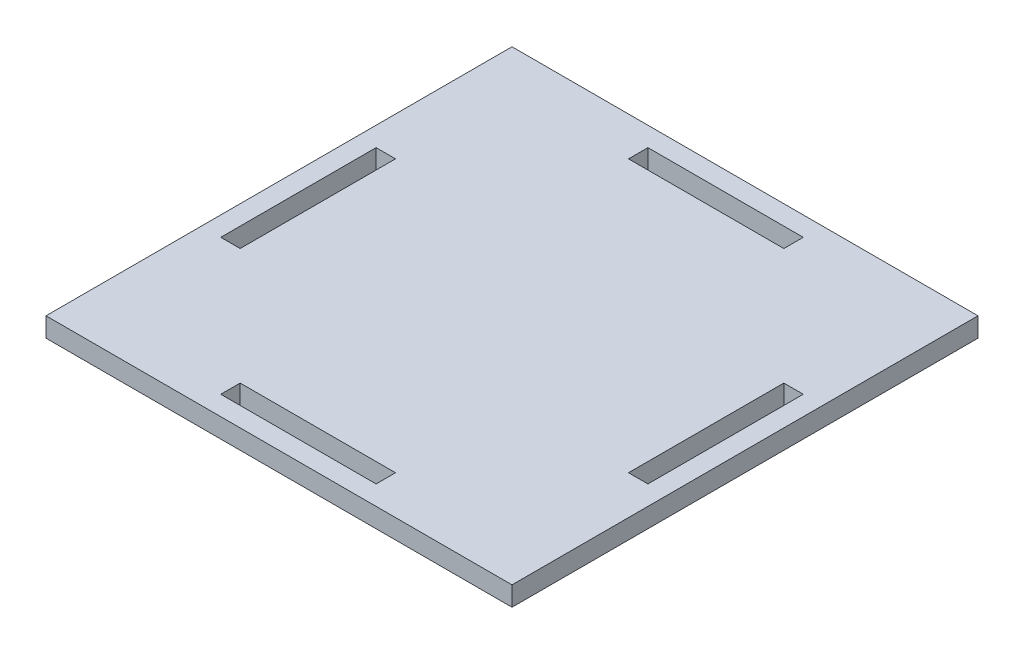
ISO-10303-21;
HEADER;
FILE_DESCRIPTION(('STEP AP214'),'2;1');
FILE_NAME('part.step','',(''),(''),'','','');
FILE_SCHEMA(('AUTOMOTIVE_DESIGN { 1 0 10303 214 1 1 1 1 }'));
ENDSEC;
DATA;
#1=APPLICATION_CONTEXT('core data for automotive mechanical design processes');
#2=APPLICATION_PROTOCOL_DEFINITION('international standard','automotive_design',2000,#1);
#3=PRODUCT_CONTEXT('',#1,'mechanical');
#4=PRODUCT('Part','Part','',(#3));
#5=PRODUCT_RELATED_PRODUCT_CATEGORY('part','',(#4));
#6=PRODUCT_DEFINITION_FORMATION('','',#4);
#7=PRODUCT_DEFINITION_CONTEXT('part definition',#1,'design');
#8=PRODUCT_DEFINITION('design','',#6,#7);
#9=PRODUCT_DEFINITION_SHAPE('','',#8);
#10=(LENGTH_UNIT() NAMED_UNIT(*) SI_UNIT(.MILLI.,.METRE.));
#11=(NAMED_UNIT(*) PLANE_ANGLE_UNIT() SI_UNIT($,.RADIAN.));
#12=(NAMED_UNIT(*) SI_UNIT($,.STERADIAN.) SOLID_ANGLE_UNIT());
#13=UNCERTAINTY_MEASURE_WITH_UNIT(LENGTH_MEASURE(1.E-05),#10,'distance_accuracy_value','');
#14=(GEOMETRIC_REPRESENTATION_CONTEXT(3) GLOBAL_UNCERTAINTY_ASSIGNED_CONTEXT((#13)) GLOBAL_UNIT_ASSIGNED_CONTEXT((#10,
#11,#12)) REPRESENTATION_CONTEXT('',''));
#15=CARTESIAN_POINT('',(0.,0.,0.));
#16=DIRECTION('',(0.,0.,1.));
#17=DIRECTION('',(1.,0.,0.));
#18=AXIS2_PLACEMENT_3D('',#15,#16,#17);
#19=CARTESIAN_POINT('',(0.,6.35,0.));
#20=DIRECTION('',(0.,1.,0.));
#21=DIRECTION('',(0.,0.,1.));
#22=AXIS2_PLACEMENT_3D('',#19,#20,#21);
#23=PLANE('',#22);
#24=DIRECTION('',(1.,0.,0.));
#25=VECTOR('',#24,1.);
#26=CARTESIAN_POINT('',(0.,6.35,0.));
#27=LINE('',#26,#25);
#28=CARTESIAN_POINT('',(0.,6.35,0.));
#29=VERTEX_POINT('',#28);
#30=CARTESIAN_POINT('',(152.4,6.35,0.));
#31=VERTEX_POINT('',#30);
#32=EDGE_CURVE('E322',#29,#31,#27,.T.);
#33=ORIENTED_EDGE('',*,*,#32,.T.);
#34=DIRECTION('',(0.,0.,-1.));
#35=VECTOR('',#34,1.);
#36=CARTESIAN_POINT('',(152.4,6.35,0.));
#37=LINE('',#36,#35);
#38=CARTESIAN_POINT('',(152.4,6.35,-152.4));
#39=VERTEX_POINT('',#38);
#40=EDGE_CURVE('E325',#31,#39,#37,.T.);
#41=ORIENTED_EDGE('',*,*,#40,.T.);
#42=DIRECTION('',(-1.,0.,0.));
#43=VECTOR('',#42,1.);
#44=CARTESIAN_POINT('',(0.,6.35,-152.4));
#45=LINE('',#44,#43);
#46=CARTESIAN_POINT('',(0.,6.35,-152.4));
#47=VERTEX_POINT('',#46);
#48=EDGE_CURVE('E328',#39,#47,#45,.T.);
#49=ORIENTED_EDGE('',*,*,#48,.T.);
#50=DIRECTION('',(0.,0.,1.));
#51=VECTOR('',#50,1.);
#52=CARTESIAN_POINT('',(0.,6.35,0.));
#53=LINE('',#52,#51);
#54=EDGE_CURVE('E330',#47,#29,#53,.T.);
#55=ORIENTED_EDGE('',*,*,#54,.T.);
#56=EDGE_LOOP('',(#33,#41,#49,#55));
#57=FACE_BOUND('',#56,.T.);
#58=DIRECTION('',(0.,0.,-1.));
#59=VECTOR('',#58,1.);
#60=CARTESIAN_POINT('',(50.7999999999997,6.35,1.11022302462515E-13));
#61=LINE('',#60,#59);
#62=CARTESIAN_POINT('',(50.8,6.35,-139.7));
#63=VERTEX_POINT('',#62);
#64=CARTESIAN_POINT('',(50.8000000000001,6.35,-146.05));
#65=VERTEX_POINT('',#64);
#66=EDGE_CURVE('E285',#63,#65,#61,.T.);
#67=ORIENTED_EDGE('',*,*,#66,.T.);
#68=DIRECTION('',(1.,0.,0.));
#69=VECTOR('',#68,1.);
#70=CARTESIAN_POINT('',(1.59594559789866E-13,6.35,-146.05));
#71=LINE('',#70,#69);
#72=CARTESIAN_POINT('',(101.6,6.35,-146.05));
#73=VERTEX_POINT('',#72);
#74=EDGE_CURVE('E288',#65,#73,#71,.T.);
#75=ORIENTED_EDGE('',*,*,#74,.T.);
#76=DIRECTION('',(0.,0.,1.));
#77=VECTOR('',#76,1.);
#78=CARTESIAN_POINT('',(101.6,6.35,0.));
#79=LINE('',#78,#77);
#80=CARTESIAN_POINT('',(101.6,6.35,-139.7));
#81=VERTEX_POINT('',#80);
#82=EDGE_CURVE('E245',#73,#81,#79,.T.);
#83=ORIENTED_EDGE('',*,*,#82,.T.);
#84=DIRECTION('',(-1.,0.,0.));
#85=VECTOR('',#84,1.);
#86=CARTESIAN_POINT('',(1.52655665885959E-13,6.35,-139.7));
#87=LINE('',#86,#85);
#88=EDGE_CURVE('E191',#81,#63,#87,.T.);
#89=ORIENTED_EDGE('',*,*,#88,.T.);
#90=EDGE_LOOP('',(#67,#75,#83,#89));
#91=FACE_BOUND('',#90,.T.);
#92=DIRECTION('',(-1.,0.,0.));
#93=VECTOR('',#92,1.);
#94=CARTESIAN_POINT('',(0.,6.35,-6.35));
#95=LINE('',#94,#93);
#96=CARTESIAN_POINT('',(101.6,6.35,-6.35));
#97=VERTEX_POINT('',#96);
#98=CARTESIAN_POINT('',(50.8,6.35,-6.35));
#99=VERTEX_POINT('',#98);
#100=EDGE_CURVE('E297',#97,#99,#95,.T.);
#101=ORIENTED_EDGE('',*,*,#100,.T.);
#102=DIRECTION('',(0.,0.,-1.));
#103=VECTOR('',#102,1.);
#104=CARTESIAN_POINT('',(50.8,6.35,0.));
#105=LINE('',#104,#103);
#106=CARTESIAN_POINT('',(50.8,6.35,-12.7));
#107=VERTEX_POINT('',#106);
#108=EDGE_CURVE('E300',#99,#107,#105,.T.);
#109=ORIENTED_EDGE('',*,*,#108,.T.);
#110=DIRECTION('',(1.,0.,0.));
#111=VECTOR('',#110,1.);
#112=CARTESIAN_POINT('',(0.,6.35,-12.7));
#113=LINE('',#112,#111);
#114=CARTESIAN_POINT('',(101.6,6.35,-12.7));
#115=VERTEX_POINT('',#114);
#116=EDGE_CURVE('E291',#107,#115,#113,.T.);
#117=ORIENTED_EDGE('',*,*,#116,.T.);
#118=DIRECTION('',(0.,0.,1.));
#119=VECTOR('',#118,1.);
#120=CARTESIAN_POINT('',(101.6,6.35,0.));
#121=LINE('',#120,#119);
#122=EDGE_CURVE('E294',#115,#97,#121,.T.);
#123=ORIENTED_EDGE('',*,*,#122,.T.);
#124=EDGE_LOOP('',(#101,#109,#117,#123));
#125=FACE_BOUND('',#124,.T.);
#126=DIRECTION('',(1.,0.,0.));
#127=VECTOR('',#126,1.);
#128=CARTESIAN_POINT('',(2.22044604925031E-13,6.35,-101.6));
#129=LINE('',#128,#127);
#130=CARTESIAN_POINT('',(139.7,6.35,-101.6));
#131=VERTEX_POINT('',#130);
#132=CARTESIAN_POINT('',(146.05,6.35,-101.6));
#133=VERTEX_POINT('',#132);
#134=EDGE_CURVE('E309',#131,#133,#129,.T.);
#135=ORIENTED_EDGE('',*,*,#134,.T.);
#136=DIRECTION('',(0.,0.,1.));
#137=VECTOR('',#136,1.);
#138=CARTESIAN_POINT('',(146.05,6.35,1.59594559789866E-13));
#139=LINE('',#138,#137);
#140=CARTESIAN_POINT('',(146.05,6.35,-50.8));
#141=VERTEX_POINT('',#140);
#142=EDGE_CURVE('E312',#133,#141,#139,.T.);
#143=ORIENTED_EDGE('',*,*,#142,.T.);
#144=DIRECTION('',(-1.,0.,0.));
#145=VECTOR('',#144,1.);
#146=CARTESIAN_POINT('',(0.,6.35,-50.8));
#147=LINE('',#146,#145);
#148=CARTESIAN_POINT('',(139.7,6.35,-50.8));
#149=VERTEX_POINT('',#148);
#150=EDGE_CURVE('E303',#141,#149,#147,.T.);
#151=ORIENTED_EDGE('',*,*,#150,.T.);
#152=DIRECTION('',(0.,0.,-1.));
#153=VECTOR('',#152,1.);
#154=CARTESIAN_POINT('',(139.7,6.35,0.));
#155=LINE('',#154,#153);
#156=EDGE_CURVE('E306',#149,#131,#155,.T.);
#157=ORIENTED_EDGE('',*,*,#156,.T.);
#158=EDGE_LOOP('',(#135,#143,#151,#157));
#159=FACE_BOUND('',#158,.T.);
#160=DIRECTION('',(-1.,0.,0.));
#161=VECTOR('',#160,1.);
#162=CARTESIAN_POINT('',(0.,6.35,-50.8));
#163=LINE('',#162,#161);
#164=CARTESIAN_POINT('',(12.7,6.35,-50.8));
#165=VERTEX_POINT('',#164);
#166=CARTESIAN_POINT('',(6.35000000000001,6.35,-50.8));
#167=VERTEX_POINT('',#166);
#168=EDGE_CURVE('E318',#165,#167,#163,.T.);
#169=ORIENTED_EDGE('',*,*,#168,.T.);
#170=DIRECTION('',(0.,0.,-1.));
#171=VECTOR('',#170,1.);
#172=CARTESIAN_POINT('',(6.35000000000001,6.35,0.));
#173=LINE('',#172,#171);
#174=CARTESIAN_POINT('',(6.35000000000001,6.35,-101.6));
#175=VERTEX_POINT('',#174);
#176=EDGE_CURVE('E244',#167,#175,#173,.T.);
#177=ORIENTED_EDGE('',*,*,#176,.T.);
#178=DIRECTION('',(1.,0.,0.));
#179=VECTOR('',#178,1.);
#180=CARTESIAN_POINT('',(0.,6.35,-101.6));
#181=LINE('',#180,#179);
#182=CARTESIAN_POINT('',(12.7,6.35,-101.6));
#183=VERTEX_POINT('',#182);
#184=EDGE_CURVE('E315',#175,#183,#181,.T.);
#185=ORIENTED_EDGE('',*,*,#184,.T.);
#186=DIRECTION('',(0.,0.,1.));
#187=VECTOR('',#186,1.);
#188=CARTESIAN_POINT('',(12.7,6.35,0.));
#189=LINE('',#188,#187);
#190=EDGE_CURVE('E252',#183,#165,#189,.T.);
#191=ORIENTED_EDGE('',*,*,#190,.T.);
#192=EDGE_LOOP('',(#169,#177,#185,#191));
#193=FACE_BOUND('',#192,.T.);
#194=ADVANCED_FACE('F36',(#57,#91,#125,#159,#193),#23,.T.);
#195=CARTESIAN_POINT('',(0.,0.,0.));
#196=DIRECTION('',(0.,1.,0.));
#197=DIRECTION('',(0.,0.,1.));
#198=AXIS2_PLACEMENT_3D('',#195,#196,#197);
#199=PLANE('',#198);
#200=DIRECTION('',(0.,0.,1.));
#201=VECTOR('',#200,1.);
#202=CARTESIAN_POINT('',(146.05,0.,1.59594559789866E-13));
#203=LINE('',#202,#201);
#204=CARTESIAN_POINT('',(146.05,0.,-101.6));
#205=VERTEX_POINT('',#204);
#206=CARTESIAN_POINT('',(146.05,0.,-50.8));
#207=VERTEX_POINT('',#206);
#208=EDGE_CURVE('E220',#205,#207,#203,.T.);
#209=ORIENTED_EDGE('',*,*,#208,.F.);
#210=DIRECTION('',(1.,0.,0.));
#211=VECTOR('',#210,1.);
#212=CARTESIAN_POINT('',(2.22044604925031E-13,0.,-101.6));
#213=LINE('',#212,#211);
#214=CARTESIAN_POINT('',(139.7,0.,-101.6));
#215=VERTEX_POINT('',#214);
#216=EDGE_CURVE('E218',#215,#205,#213,.T.);
#217=ORIENTED_EDGE('',*,*,#216,.F.);
#218=DIRECTION('',(0.,0.,-1.));
#219=VECTOR('',#218,1.);
#220=CARTESIAN_POINT('',(139.7,0.,0.));
#221=LINE('',#220,#219);
#222=CARTESIAN_POINT('',(139.7,0.,-50.8));
#223=VERTEX_POINT('',#222);
#224=EDGE_CURVE('E216',#223,#215,#221,.T.);
#225=ORIENTED_EDGE('',*,*,#224,.F.);
#226=DIRECTION('',(-1.,0.,0.));
#227=VECTOR('',#226,1.);
#228=CARTESIAN_POINT('',(0.,0.,-50.8));
#229=LINE('',#228,#227);
#230=EDGE_CURVE('E214',#207,#223,#229,.T.);
#231=ORIENTED_EDGE('',*,*,#230,.F.);
#232=EDGE_LOOP('',(#209,#217,#225,#231));
#233=FACE_BOUND('',#232,.T.);
#234=DIRECTION('',(1.,0.,0.));
#235=VECTOR('',#234,1.);
#236=CARTESIAN_POINT('',(1.59594559789866E-13,0.,-146.05));
#237=LINE('',#236,#235);
#238=CARTESIAN_POINT('',(50.8000000000001,0.,-146.05));
#239=VERTEX_POINT('',#238);
#240=CARTESIAN_POINT('',(101.6,0.,-146.05));
#241=VERTEX_POINT('',#240);
#242=EDGE_CURVE('E200',#239,#241,#237,.T.);
#243=ORIENTED_EDGE('',*,*,#242,.F.);
#244=DIRECTION('',(0.,0.,-1.));
#245=VECTOR('',#244,1.);
#246=CARTESIAN_POINT('',(50.7999999999997,0.,1.11022302462515E-13));
#247=LINE('',#246,#245);
#248=CARTESIAN_POINT('',(50.8,0.,-139.7));
#249=VERTEX_POINT('',#248);
#250=EDGE_CURVE('E198',#249,#239,#247,.T.);
#251=ORIENTED_EDGE('',*,*,#250,.F.);
#252=DIRECTION('',(-1.,0.,0.));
#253=VECTOR('',#252,1.);
#254=CARTESIAN_POINT('',(1.52655665885959E-13,0.,-139.7));
#255=LINE('',#254,#253);
#256=CARTESIAN_POINT('',(101.6,0.,-139.7));
#257=VERTEX_POINT('',#256);
#258=EDGE_CURVE('E183',#257,#249,#255,.T.);
#259=ORIENTED_EDGE('',*,*,#258,.F.);
#260=DIRECTION('',(0.,0.,1.));
#261=VECTOR('',#260,1.);
#262=CARTESIAN_POINT('',(101.6,0.,0.));
#263=LINE('',#262,#261);
#264=EDGE_CURVE('E172',#241,#257,#263,.T.);
#265=ORIENTED_EDGE('',*,*,#264,.F.);
#266=EDGE_LOOP('',(#243,#251,#259,#265));
#267=FACE_BOUND('',#266,.T.);
#268=DIRECTION('',(1.,0.,0.));
#269=VECTOR('',#268,1.);
#270=CARTESIAN_POINT('',(0.,0.,0.));
#271=LINE('',#270,#269);
#272=CARTESIAN_POINT('',(0.,0.,0.));
#273=VERTEX_POINT('',#272);
#274=CARTESIAN_POINT('',(152.4,0.,0.));
#275=VERTEX_POINT('',#274);
#276=EDGE_CURVE('E321',#273,#275,#271,.T.);
#277=ORIENTED_EDGE('',*,*,#276,.F.);
#278=DIRECTION('',(0.,0.,1.));
#279=VECTOR('',#278,1.);
#280=CARTESIAN_POINT('',(0.,0.,0.));
#281=LINE('',#280,#279);
#282=CARTESIAN_POINT('',(0.,0.,-152.4));
#283=VERTEX_POINT('',#282);
#284=EDGE_CURVE('E326',#283,#273,#281,.T.);
#285=ORIENTED_EDGE('',*,*,#284,.F.);
#286=DIRECTION('',(-1.,0.,0.));
#287=VECTOR('',#286,1.);
#288=CARTESIAN_POINT('',(0.,0.,-152.4));
#289=LINE('',#288,#287);
#290=CARTESIAN_POINT('',(152.4,0.,-152.4));
#291=VERTEX_POINT('',#290);
#292=EDGE_CURVE('E337',#291,#283,#289,.T.);
#293=ORIENTED_EDGE('',*,*,#292,.F.);
#294=DIRECTION('',(0.,0.,-1.));
#295=VECTOR('',#294,1.);
#296=CARTESIAN_POINT('',(152.4,0.,0.));
#297=LINE('',#296,#295);
#298=EDGE_CURVE('E335',#275,#291,#297,.T.);
#299=ORIENTED_EDGE('',*,*,#298,.F.);
#300=EDGE_LOOP('',(#277,#285,#293,#299));
#301=FACE_BOUND('',#300,.T.);
#302=DIRECTION('',(0.,0.,-1.));
#303=VECTOR('',#302,1.);
#304=CARTESIAN_POINT('',(50.8,0.,0.));
#305=LINE('',#304,#303);
#306=CARTESIAN_POINT('',(50.8,0.,-6.35));
#307=VERTEX_POINT('',#306);
#308=CARTESIAN_POINT('',(50.8,0.,-12.7));
#309=VERTEX_POINT('',#308);
#310=EDGE_CURVE('E211',#307,#309,#305,.T.);
#311=ORIENTED_EDGE('',*,*,#310,.F.);
#312=DIRECTION('',(-1.,0.,0.));
#313=VECTOR('',#312,1.);
#314=CARTESIAN_POINT('',(0.,0.,-6.35));
#315=LINE('',#314,#313);
#316=CARTESIAN_POINT('',(101.6,0.,-6.35));
#317=VERTEX_POINT('',#316);
#318=EDGE_CURVE('E209',#317,#307,#315,.T.);
#319=ORIENTED_EDGE('',*,*,#318,.F.);
#320=DIRECTION('',(0.,0.,1.));
#321=VECTOR('',#320,1.);
#322=CARTESIAN_POINT('',(101.6,0.,0.));
#323=LINE('',#322,#321);
#324=CARTESIAN_POINT('',(101.6,0.,-12.7));
#325=VERTEX_POINT('',#324);
#326=EDGE_CURVE('E207',#325,#317,#323,.T.);
#327=ORIENTED_EDGE('',*,*,#326,.F.);
#328=DIRECTION('',(1.,0.,0.));
#329=VECTOR('',#328,1.);
#330=CARTESIAN_POINT('',(0.,0.,-12.7));
#331=LINE('',#330,#329);
#332=EDGE_CURVE('E205',#309,#325,#331,.T.);
#333=ORIENTED_EDGE('',*,*,#332,.F.);
#334=EDGE_LOOP('',(#311,#319,#327,#333));
#335=FACE_BOUND('',#334,.T.);
#336=DIRECTION('',(0.,0.,-1.));
#337=VECTOR('',#336,1.);
#338=CARTESIAN_POINT('',(6.35000000000001,0.,0.));
#339=LINE('',#338,#337);
#340=CARTESIAN_POINT('',(6.35000000000001,0.,-50.8));
#341=VERTEX_POINT('',#340);
#342=CARTESIAN_POINT('',(6.35000000000001,0.,-101.6));
#343=VERTEX_POINT('',#342);
#344=EDGE_CURVE('E11',#341,#343,#339,.T.);
#345=ORIENTED_EDGE('',*,*,#344,.F.);
#346=DIRECTION('',(-1.,0.,0.));
#347=VECTOR('',#346,1.);
#348=CARTESIAN_POINT('',(0.,0.,-50.8));
#349=LINE('',#348,#347);
#350=CARTESIAN_POINT('',(12.7,0.,-50.8));
#351=VERTEX_POINT('',#350);
#352=EDGE_CURVE('E44',#351,#341,#349,.T.);
#353=ORIENTED_EDGE('',*,*,#352,.F.);
#354=DIRECTION('',(0.,0.,1.));
#355=VECTOR('',#354,1.);
#356=CARTESIAN_POINT('',(12.7,0.,0.));
#357=LINE('',#356,#355);
#358=CARTESIAN_POINT('',(12.7,0.,-101.6));
#359=VERTEX_POINT('',#358);
#360=EDGE_CURVE('E225',#359,#351,#357,.T.);
#361=ORIENTED_EDGE('',*,*,#360,.F.);
#362=DIRECTION('',(1.,0.,0.));
#363=VECTOR('',#362,1.);
#364=CARTESIAN_POINT('',(0.,0.,-101.6));
#365=LINE('',#364,#363);
#366=EDGE_CURVE('E223',#343,#359,#365,.T.);
#367=ORIENTED_EDGE('',*,*,#366,.F.);
#368=EDGE_LOOP('',(#345,#353,#361,#367));
#369=FACE_BOUND('',#368,.T.);
#370=ADVANCED_FACE('F196',(#233,#267,#301,#335,#369),#199,.F.);
#371=CARTESIAN_POINT('',(0.,6.35,0.));
#372=DIRECTION('',(0.,0.,-1.));
#373=DIRECTION('',(-1.,0.,0.));
#374=AXIS2_PLACEMENT_3D('',#371,#372,#373);
#375=PLANE('',#374);
#376=ORIENTED_EDGE('',*,*,#276,.T.);
#377=DIRECTION('',(0.,-1.,0.));
#378=VECTOR('',#377,1.);
#379=CARTESIAN_POINT('',(152.4,6.35,0.));
#380=LINE('',#379,#378);
#381=EDGE_CURVE('E184',#31,#275,#380,.T.);
#382=ORIENTED_EDGE('',*,*,#381,.F.);
#383=ORIENTED_EDGE('',*,*,#32,.F.);
#384=DIRECTION('',(0.,-1.,0.));
#385=VECTOR('',#384,1.);
#386=CARTESIAN_POINT('',(0.,6.35,0.));
#387=LINE('',#386,#385);
#388=EDGE_CURVE('E332',#29,#273,#387,.T.);
#389=ORIENTED_EDGE('',*,*,#388,.T.);
#390=EDGE_LOOP('',(#376,#382,#383,#389));
#391=FACE_BOUND('',#390,.T.);
#392=ADVANCED_FACE('F38',(#391),#375,.F.);
#393=CARTESIAN_POINT('',(152.4,6.35,0.));
#394=DIRECTION('',(-1.,0.,0.));
#395=DIRECTION('',(0.,0.,1.));
#396=AXIS2_PLACEMENT_3D('',#393,#394,#395);
#397=PLANE('',#396);
#398=ORIENTED_EDGE('',*,*,#298,.T.);
#399=DIRECTION('',(0.,-1.,0.));
#400=VECTOR('',#399,1.);
#401=CARTESIAN_POINT('',(152.4,6.35,-152.4));
#402=LINE('',#401,#400);
#403=EDGE_CURVE('E345',#39,#291,#402,.T.);
#404=ORIENTED_EDGE('',*,*,#403,.F.);
#405=ORIENTED_EDGE('',*,*,#40,.F.);
#406=ORIENTED_EDGE('',*,*,#381,.T.);
#407=EDGE_LOOP('',(#398,#404,#405,#406));
#408=FACE_BOUND('',#407,.T.);
#409=ADVANCED_FACE('F350',(#408),#397,.F.);
#410=CARTESIAN_POINT('',(0.,6.35,-152.4));
#411=DIRECTION('',(0.,0.,1.));
#412=DIRECTION('',(1.,0.,0.));
#413=AXIS2_PLACEMENT_3D('',#410,#411,#412);
#414=PLANE('',#413);
#415=ORIENTED_EDGE('',*,*,#292,.T.);
#416=DIRECTION('',(0.,-1.,0.));
#417=VECTOR('',#416,1.);
#418=CARTESIAN_POINT('',(0.,6.35,-152.4));
#419=LINE('',#418,#417);
#420=EDGE_CURVE('E342',#47,#283,#419,.T.);
#421=ORIENTED_EDGE('',*,*,#420,.F.);
#422=ORIENTED_EDGE('',*,*,#48,.F.);
#423=ORIENTED_EDGE('',*,*,#403,.T.);
#424=EDGE_LOOP('',(#415,#421,#422,#423));
#425=FACE_BOUND('',#424,.T.);
#426=ADVANCED_FACE('F361',(#425),#414,.F.);
#427=CARTESIAN_POINT('',(0.,6.35,0.));
#428=DIRECTION('',(1.,0.,0.));
#429=DIRECTION('',(0.,0.,-1.));
#430=AXIS2_PLACEMENT_3D('',#427,#428,#429);
#431=PLANE('',#430);
#432=ORIENTED_EDGE('',*,*,#284,.T.);
#433=ORIENTED_EDGE('',*,*,#388,.F.);
#434=ORIENTED_EDGE('',*,*,#54,.F.);
#435=ORIENTED_EDGE('',*,*,#420,.T.);
#436=EDGE_LOOP('',(#432,#433,#434,#435));
#437=FACE_BOUND('',#436,.T.);
#438=ADVANCED_FACE('F365',(#437),#431,.F.);
#439=CARTESIAN_POINT('',(50.8000000000001,12.7,-146.05));
#440=DIRECTION('',(0.,0.,1.));
#441=DIRECTION('',(1.,0.,0.));
#442=AXIS2_PLACEMENT_3D('',#439,#440,#441);
#443=PLANE('',#442);
#444=DIRECTION('',(0.,-1.,0.));
#445=VECTOR('',#444,1.);
#446=CARTESIAN_POINT('',(50.8000000000001,12.7,-146.05));
#447=LINE('',#446,#445);
#448=EDGE_CURVE('E271',#65,#239,#447,.T.);
#449=ORIENTED_EDGE('',*,*,#448,.T.);
#450=ORIENTED_EDGE('',*,*,#242,.T.);
#451=DIRECTION('',(0.,-1.,0.));
#452=VECTOR('',#451,1.);
#453=CARTESIAN_POINT('',(101.6,12.7,-146.05));
#454=LINE('',#453,#452);
#455=EDGE_CURVE('E178',#73,#241,#454,.T.);
#456=ORIENTED_EDGE('',*,*,#455,.F.);
#457=ORIENTED_EDGE('',*,*,#74,.F.);
#458=EDGE_LOOP('',(#449,#450,#456,#457));
#459=FACE_BOUND('',#458,.T.);
#460=ADVANCED_FACE('F425',(#459),#443,.T.);
#461=CARTESIAN_POINT('',(50.8000000000001,12.7,-146.05));
#462=DIRECTION('',(1.,0.,0.));
#463=DIRECTION('',(0.,0.,-1.));
#464=AXIS2_PLACEMENT_3D('',#461,#462,#463);
#465=PLANE('',#464);
#466=DIRECTION('',(0.,-1.,0.));
#467=VECTOR('',#466,1.);
#468=CARTESIAN_POINT('',(50.8,12.7,-139.7));
#469=LINE('',#468,#467);
#470=EDGE_CURVE('E193',#63,#249,#469,.T.);
#471=ORIENTED_EDGE('',*,*,#470,.T.);
#472=ORIENTED_EDGE('',*,*,#250,.T.);
#473=ORIENTED_EDGE('',*,*,#448,.F.);
#474=ORIENTED_EDGE('',*,*,#66,.F.);
#475=EDGE_LOOP('',(#471,#472,#473,#474));
#476=FACE_BOUND('',#475,.T.);
#477=ADVANCED_FACE('F422',(#476),#465,.T.);
#478=CARTESIAN_POINT('',(50.8,12.7,-139.7));
#479=DIRECTION('',(0.,0.,-1.));
#480=DIRECTION('',(-1.,0.,0.));
#481=AXIS2_PLACEMENT_3D('',#478,#479,#480);
#482=PLANE('',#481);
#483=DIRECTION('',(0.,-1.,0.));
#484=VECTOR('',#483,1.);
#485=CARTESIAN_POINT('',(101.6,12.7,-139.7));
#486=LINE('',#485,#484);
#487=EDGE_CURVE('E175',#81,#257,#486,.T.);
#488=ORIENTED_EDGE('',*,*,#487,.T.);
#489=ORIENTED_EDGE('',*,*,#258,.T.);
#490=ORIENTED_EDGE('',*,*,#470,.F.);
#491=ORIENTED_EDGE('',*,*,#88,.F.);
#492=EDGE_LOOP('',(#488,#489,#490,#491));
#493=FACE_BOUND('',#492,.T.);
#494=ADVANCED_FACE('F187',(#493),#482,.T.);
#495=CARTESIAN_POINT('',(101.6,12.7,-146.05));
#496=DIRECTION('',(-1.,0.,0.));
#497=DIRECTION('',(0.,0.,1.));
#498=AXIS2_PLACEMENT_3D('',#495,#496,#497);
#499=PLANE('',#498);
#500=ORIENTED_EDGE('',*,*,#455,.T.);
#501=ORIENTED_EDGE('',*,*,#264,.T.);
#502=ORIENTED_EDGE('',*,*,#487,.F.);
#503=ORIENTED_EDGE('',*,*,#82,.F.);
#504=EDGE_LOOP('',(#500,#501,#502,#503));
#505=FACE_BOUND('',#504,.T.);
#506=ADVANCED_FACE('F174',(#505),#499,.T.);
#507=CARTESIAN_POINT('',(50.8,12.7,-6.35));
#508=DIRECTION('',(1.,0.,0.));
#509=DIRECTION('',(0.,0.,-1.));
#510=AXIS2_PLACEMENT_3D('',#507,#508,#509);
#511=PLANE('',#510);
#512=DIRECTION('',(0.,-1.,0.));
#513=VECTOR('',#512,1.);
#514=CARTESIAN_POINT('',(50.8,12.7,-6.35));
#515=LINE('',#514,#513);
#516=EDGE_CURVE('E261',#99,#307,#515,.T.);
#517=ORIENTED_EDGE('',*,*,#516,.T.);
#518=ORIENTED_EDGE('',*,*,#310,.T.);
#519=DIRECTION('',(0.,-1.,0.));
#520=VECTOR('',#519,1.);
#521=CARTESIAN_POINT('',(50.8,12.7,-12.7));
#522=LINE('',#521,#520);
#523=EDGE_CURVE('E268',#107,#309,#522,.T.);
#524=ORIENTED_EDGE('',*,*,#523,.F.);
#525=ORIENTED_EDGE('',*,*,#108,.F.);
#526=EDGE_LOOP('',(#517,#518,#524,#525));
#527=FACE_BOUND('',#526,.T.);
#528=ADVANCED_FACE('F413',(#527),#511,.T.);
#529=CARTESIAN_POINT('',(50.8,12.7,-6.35));
#530=DIRECTION('',(0.,0.,-1.));
#531=DIRECTION('',(-1.,0.,0.));
#532=AXIS2_PLACEMENT_3D('',#529,#530,#531);
#533=PLANE('',#532);
#534=DIRECTION('',(0.,-1.,0.));
#535=VECTOR('',#534,1.);
#536=CARTESIAN_POINT('',(101.6,12.7,-6.35));
#537=LINE('',#536,#535);
#538=EDGE_CURVE('E274',#97,#317,#537,.T.);
#539=ORIENTED_EDGE('',*,*,#538,.T.);
#540=ORIENTED_EDGE('',*,*,#318,.T.);
#541=ORIENTED_EDGE('',*,*,#516,.F.);
#542=ORIENTED_EDGE('',*,*,#100,.F.);
#543=EDGE_LOOP('',(#539,#540,#541,#542));
#544=FACE_BOUND('',#543,.T.);
#545=ADVANCED_FACE('F409',(#544),#533,.T.);
#546=CARTESIAN_POINT('',(101.6,12.7,-6.35));
#547=DIRECTION('',(-1.,0.,0.));
#548=DIRECTION('',(0.,0.,1.));
#549=AXIS2_PLACEMENT_3D('',#546,#547,#548);
#550=PLANE('',#549);
#551=DIRECTION('',(0.,-1.,0.));
#552=VECTOR('',#551,1.);
#553=CARTESIAN_POINT('',(101.6,12.7,-12.7));
#554=LINE('',#553,#552);
#555=EDGE_CURVE('E270',#115,#325,#554,.T.);
#556=ORIENTED_EDGE('',*,*,#555,.T.);
#557=ORIENTED_EDGE('',*,*,#326,.T.);
#558=ORIENTED_EDGE('',*,*,#538,.F.);
#559=ORIENTED_EDGE('',*,*,#122,.F.);
#560=EDGE_LOOP('',(#556,#557,#558,#559));
#561=FACE_BOUND('',#560,.T.);
#562=ADVANCED_FACE('F405',(#561),#550,.T.);
#563=CARTESIAN_POINT('',(50.8,12.7,-12.7));
#564=DIRECTION('',(0.,0.,1.));
#565=DIRECTION('',(1.,0.,0.));
#566=AXIS2_PLACEMENT_3D('',#563,#564,#565);
#567=PLANE('',#566);
#568=ORIENTED_EDGE('',*,*,#523,.T.);
#569=ORIENTED_EDGE('',*,*,#332,.T.);
#570=ORIENTED_EDGE('',*,*,#555,.F.);
#571=ORIENTED_EDGE('',*,*,#116,.F.);
#572=EDGE_LOOP('',(#568,#569,#570,#571));
#573=FACE_BOUND('',#572,.T.);
#574=ADVANCED_FACE('F402',(#573),#567,.T.);
#575=CARTESIAN_POINT('',(146.05,12.7,-101.6));
#576=DIRECTION('',(-1.,0.,0.));
#577=DIRECTION('',(0.,0.,1.));
#578=AXIS2_PLACEMENT_3D('',#575,#576,#577);
#579=PLANE('',#578);
#580=DIRECTION('',(0.,-1.,0.));
#581=VECTOR('',#580,1.);
#582=CARTESIAN_POINT('',(146.05,12.7,-101.6));
#583=LINE('',#582,#581);
#584=EDGE_CURVE('E256',#133,#205,#583,.T.);
#585=ORIENTED_EDGE('',*,*,#584,.T.);
#586=ORIENTED_EDGE('',*,*,#208,.T.);
#587=DIRECTION('',(0.,-1.,0.));
#588=VECTOR('',#587,1.);
#589=CARTESIAN_POINT('',(146.05,12.7,-50.8));
#590=LINE('',#589,#588);
#591=EDGE_CURVE('E259',#141,#207,#590,.T.);
#592=ORIENTED_EDGE('',*,*,#591,.F.);
#593=ORIENTED_EDGE('',*,*,#142,.F.);
#594=EDGE_LOOP('',(#585,#586,#592,#593));
#595=FACE_BOUND('',#594,.T.);
#596=ADVANCED_FACE('F385',(#595),#579,.T.);
#597=CARTESIAN_POINT('',(146.05,12.7,-101.6));
#598=DIRECTION('',(0.,0.,1.));
#599=DIRECTION('',(1.,0.,0.));
#600=AXIS2_PLACEMENT_3D('',#597,#598,#599);
#601=PLANE('',#600);
#602=DIRECTION('',(0.,-1.,0.));
#603=VECTOR('',#602,1.);
#604=CARTESIAN_POINT('',(139.7,12.7,-101.6));
#605=LINE('',#604,#603);
#606=EDGE_CURVE('E263',#131,#215,#605,.T.);
#607=ORIENTED_EDGE('',*,*,#606,.T.);
#608=ORIENTED_EDGE('',*,*,#216,.T.);
#609=ORIENTED_EDGE('',*,*,#584,.F.);
#610=ORIENTED_EDGE('',*,*,#134,.F.);
#611=EDGE_LOOP('',(#607,#608,#609,#610));
#612=FACE_BOUND('',#611,.T.);
#613=ADVANCED_FACE('F376',(#612),#601,.T.);
#614=CARTESIAN_POINT('',(139.7,12.7,-101.6));
#615=DIRECTION('',(1.,0.,0.));
#616=DIRECTION('',(0.,0.,-1.));
#617=AXIS2_PLACEMENT_3D('',#614,#615,#616);
#618=PLANE('',#617);
#619=DIRECTION('',(0.,-1.,0.));
#620=VECTOR('',#619,1.);
#621=CARTESIAN_POINT('',(139.7,12.7,-50.8));
#622=LINE('',#621,#620);
#623=EDGE_CURVE('E59',#149,#223,#622,.T.);
#624=ORIENTED_EDGE('',*,*,#623,.T.);
#625=ORIENTED_EDGE('',*,*,#224,.T.);
#626=ORIENTED_EDGE('',*,*,#606,.F.);
#627=ORIENTED_EDGE('',*,*,#156,.F.);
#628=EDGE_LOOP('',(#624,#625,#626,#627));
#629=FACE_BOUND('',#628,.T.);
#630=ADVANCED_FACE('F379',(#629),#618,.T.);
#631=CARTESIAN_POINT('',(146.05,12.7,-50.8));
#632=DIRECTION('',(0.,0.,-1.));
#633=DIRECTION('',(-1.,0.,0.));
#634=AXIS2_PLACEMENT_3D('',#631,#632,#633);
#635=PLANE('',#634);
#636=ORIENTED_EDGE('',*,*,#591,.T.);
#637=ORIENTED_EDGE('',*,*,#230,.T.);
#638=ORIENTED_EDGE('',*,*,#623,.F.);
#639=ORIENTED_EDGE('',*,*,#150,.F.);
#640=EDGE_LOOP('',(#636,#637,#638,#639));
#641=FACE_BOUND('',#640,.T.);
#642=ADVANCED_FACE('F387',(#641),#635,.T.);
#643=CARTESIAN_POINT('',(6.35000000000001,12.7,-101.6));
#644=DIRECTION('',(1.,0.,0.));
#645=DIRECTION('',(0.,0.,-1.));
#646=AXIS2_PLACEMENT_3D('',#643,#644,#645);
#647=PLANE('',#646);
#648=DIRECTION('',(0.,-1.,0.));
#649=VECTOR('',#648,1.);
#650=CARTESIAN_POINT('',(6.35000000000001,12.7,-50.8));
#651=LINE('',#650,#649);
#652=EDGE_CURVE('E232',#167,#341,#651,.T.);
#653=ORIENTED_EDGE('',*,*,#652,.T.);
#654=ORIENTED_EDGE('',*,*,#344,.T.);
#655=DIRECTION('',(0.,-1.,0.));
#656=VECTOR('',#655,1.);
#657=CARTESIAN_POINT('',(6.35000000000001,12.7,-101.6));
#658=LINE('',#657,#656);
#659=EDGE_CURVE('E248',#175,#343,#658,.T.);
#660=ORIENTED_EDGE('',*,*,#659,.F.);
#661=ORIENTED_EDGE('',*,*,#176,.F.);
#662=EDGE_LOOP('',(#653,#654,#660,#661));
#663=FACE_BOUND('',#662,.T.);
#664=ADVANCED_FACE('F240',(#663),#647,.T.);
#665=CARTESIAN_POINT('',(6.35000000000001,12.7,-50.8));
#666=DIRECTION('',(0.,0.,-1.));
#667=DIRECTION('',(-1.,0.,0.));
#668=AXIS2_PLACEMENT_3D('',#665,#666,#667);
#669=PLANE('',#668);
#670=DIRECTION('',(0.,-1.,0.));
#671=VECTOR('',#670,1.);
#672=CARTESIAN_POINT('',(12.7,12.7,-50.8));
#673=LINE('',#672,#671);
#674=EDGE_CURVE('E235',#165,#351,#673,.T.);
#675=ORIENTED_EDGE('',*,*,#674,.T.);
#676=ORIENTED_EDGE('',*,*,#352,.T.);
#677=ORIENTED_EDGE('',*,*,#652,.F.);
#678=ORIENTED_EDGE('',*,*,#168,.F.);
#679=EDGE_LOOP('',(#675,#676,#677,#678));
#680=FACE_BOUND('',#679,.T.);
#681=ADVANCED_FACE('F231',(#680),#669,.T.);
#682=CARTESIAN_POINT('',(12.7,12.7,-101.6));
#683=DIRECTION('',(-1.,0.,0.));
#684=DIRECTION('',(0.,0.,1.));
#685=AXIS2_PLACEMENT_3D('',#682,#683,#684);
#686=PLANE('',#685);
#687=DIRECTION('',(0.,-1.,0.));
#688=VECTOR('',#687,1.);
#689=CARTESIAN_POINT('',(12.7,12.7,-101.6));
#690=LINE('',#689,#688);
#691=EDGE_CURVE('E51',#183,#359,#690,.T.);
#692=ORIENTED_EDGE('',*,*,#691,.T.);
#693=ORIENTED_EDGE('',*,*,#360,.T.);
#694=ORIENTED_EDGE('',*,*,#674,.F.);
#695=ORIENTED_EDGE('',*,*,#190,.F.);
#696=EDGE_LOOP('',(#692,#693,#694,#695));
#697=FACE_BOUND('',#696,.T.);
#698=ADVANCED_FACE('F250',(#697),#686,.T.);
#699=CARTESIAN_POINT('',(6.35000000000001,12.7,-101.6));
#700=DIRECTION('',(0.,0.,1.));
#701=DIRECTION('',(1.,0.,0.));
#702=AXIS2_PLACEMENT_3D('',#699,#700,#701);
#703=PLANE('',#702);
#704=ORIENTED_EDGE('',*,*,#659,.T.);
#705=ORIENTED_EDGE('',*,*,#366,.T.);
#706=ORIENTED_EDGE('',*,*,#691,.F.);
#707=ORIENTED_EDGE('',*,*,#184,.F.);
#708=EDGE_LOOP('',(#704,#705,#706,#707));
#709=FACE_BOUND('',#708,.T.);
#710=ADVANCED_FACE('F247',(#709),#703,.T.);
#711=CLOSED_SHELL('',(#194,#370,#392,#409,#426,#438,#460,#477,#494,#506,#528,#545,#562,#574,
#596,#613,#630,#642,#664,#681,#698,#710));
#712=MANIFOLD_SOLID_BREP('B2',#711);
#713=ADVANCED_BREP_SHAPE_REPRESENTATION('',(#18,#712),#14);
#714=SHAPE_DEFINITION_REPRESENTATION(#9,#713);
ENDSEC;
END-ISO-10303-21;
